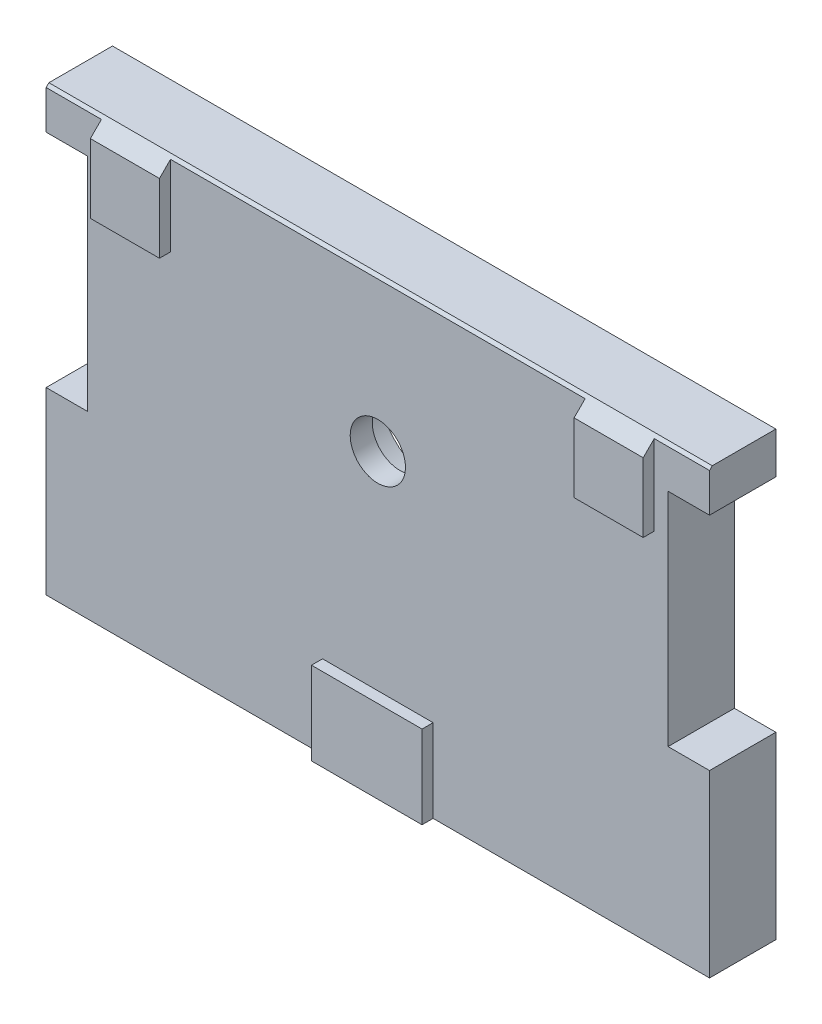
ISO-10303-21;
HEADER;
FILE_DESCRIPTION(('STEP AP214'),'2;1');
FILE_NAME('part.step','',(''),(''),'','','');
FILE_SCHEMA(('AUTOMOTIVE_DESIGN { 1 0 10303 214 1 1 1 1 }'));
ENDSEC;
DATA;
#1=APPLICATION_CONTEXT('core data for automotive mechanical design processes');
#2=APPLICATION_PROTOCOL_DEFINITION('international standard','automotive_design',2000,#1);
#3=PRODUCT_CONTEXT('',#1,'mechanical');
#4=PRODUCT('Part','Part','',(#3));
#5=PRODUCT_RELATED_PRODUCT_CATEGORY('part','',(#4));
#6=PRODUCT_DEFINITION_FORMATION('','',#4);
#7=PRODUCT_DEFINITION_CONTEXT('part definition',#1,'design');
#8=PRODUCT_DEFINITION('design','',#6,#7);
#9=PRODUCT_DEFINITION_SHAPE('','',#8);
#10=(LENGTH_UNIT() NAMED_UNIT(*) SI_UNIT(.MILLI.,.METRE.));
#11=(NAMED_UNIT(*) PLANE_ANGLE_UNIT() SI_UNIT($,.RADIAN.));
#12=(NAMED_UNIT(*) SI_UNIT($,.STERADIAN.) SOLID_ANGLE_UNIT());
#13=UNCERTAINTY_MEASURE_WITH_UNIT(LENGTH_MEASURE(1.E-05),#10,'distance_accuracy_value','');
#14=(GEOMETRIC_REPRESENTATION_CONTEXT(3) GLOBAL_UNCERTAINTY_ASSIGNED_CONTEXT((#13)) GLOBAL_UNIT_ASSIGNED_CONTEXT((#10,
#11,#12)) REPRESENTATION_CONTEXT('',''));
#15=CARTESIAN_POINT('',(0.,0.,0.));
#16=DIRECTION('',(0.,0.,1.));
#17=DIRECTION('',(1.,0.,0.));
#18=AXIS2_PLACEMENT_3D('',#15,#16,#17);
#19=CARTESIAN_POINT('',(-10.1117315438873,0.,2.4));
#20=DIRECTION('',(-1.,0.,0.));
#21=DIRECTION('',(0.,0.,1.));
#22=AXIS2_PLACEMENT_3D('',#19,#20,#21);
#23=PLANE('',#22);
#24=DIRECTION('',(0.,1.,0.));
#25=VECTOR('',#24,1.);
#26=CARTESIAN_POINT('',(-10.1117315438873,8.,2.4));
#27=LINE('',#26,#25);
#28=CARTESIAN_POINT('',(-10.1117315438873,0.,2.4));
#29=VERTEX_POINT('',#28);
#30=CARTESIAN_POINT('',(-10.1117315438873,3.,2.4));
#31=VERTEX_POINT('',#30);
#32=EDGE_CURVE('E303',#29,#31,#27,.T.);
#33=ORIENTED_EDGE('',*,*,#32,.F.);
#34=DIRECTION('',(0.,0.,1.));
#35=VECTOR('',#34,1.);
#36=CARTESIAN_POINT('',(-10.1117315438873,0.,2.4));
#37=LINE('',#36,#35);
#38=CARTESIAN_POINT('',(-10.1117315438873,0.,2.8));
#39=VERTEX_POINT('',#38);
#40=EDGE_CURVE('E230',#29,#39,#37,.T.);
#41=ORIENTED_EDGE('',*,*,#40,.T.);
#42=DIRECTION('',(0.,-1.,0.));
#43=VECTOR('',#42,1.);
#44=CARTESIAN_POINT('',(-10.1117315438873,1.5,2.8));
#45=LINE('',#44,#43);
#46=CARTESIAN_POINT('',(-10.1117315438873,3.,2.8));
#47=VERTEX_POINT('',#46);
#48=EDGE_CURVE('E317',#47,#39,#45,.T.);
#49=ORIENTED_EDGE('',*,*,#48,.F.);
#50=DIRECTION('',(0.,0.,1.));
#51=VECTOR('',#50,1.);
#52=CARTESIAN_POINT('',(-10.1117315438873,3.,2.4));
#53=LINE('',#52,#51);
#54=EDGE_CURVE('E228',#31,#47,#53,.T.);
#55=ORIENTED_EDGE('',*,*,#54,.F.);
#56=EDGE_LOOP('',(#33,#41,#49,#55));
#57=FACE_BOUND('',#56,.T.);
#58=ADVANCED_FACE('F16',(#57),#23,.T.);
#59=CARTESIAN_POINT('',(-10.1117315438873,3.,2.4));
#60=DIRECTION('',(0.,1.,0.));
#61=DIRECTION('',(0.,0.,1.));
#62=AXIS2_PLACEMENT_3D('',#59,#60,#61);
#63=PLANE('',#62);
#64=DIRECTION('',(1.,0.,0.));
#65=VECTOR('',#64,1.);
#66=CARTESIAN_POINT('',(-8.11173154388726,3.,2.4));
#67=LINE('',#66,#65);
#68=CARTESIAN_POINT('',(-6.11173154388727,3.,2.4));
#69=VERTEX_POINT('',#68);
#70=EDGE_CURVE('E301',#31,#69,#67,.T.);
#71=ORIENTED_EDGE('',*,*,#70,.F.);
#72=ORIENTED_EDGE('',*,*,#54,.T.);
#73=DIRECTION('',(1.,0.,0.));
#74=VECTOR('',#73,1.);
#75=CARTESIAN_POINT('',(-8.11173154388727,3.,2.8));
#76=LINE('',#75,#74);
#77=CARTESIAN_POINT('',(-6.11173154388727,3.,2.8));
#78=VERTEX_POINT('',#77);
#79=EDGE_CURVE('E311',#78,#47,#76,.F.);
#80=ORIENTED_EDGE('',*,*,#79,.F.);
#81=DIRECTION('',(0.,0.,-1.));
#82=VECTOR('',#81,1.);
#83=CARTESIAN_POINT('',(-6.11173154388727,3.,2.4));
#84=LINE('',#83,#82);
#85=EDGE_CURVE('E224',#69,#78,#84,.F.);
#86=ORIENTED_EDGE('',*,*,#85,.F.);
#87=EDGE_LOOP('',(#71,#72,#80,#86));
#88=FACE_BOUND('',#87,.T.);
#89=ADVANCED_FACE('F649',(#88),#63,.T.);
#90=CARTESIAN_POINT('',(-6.11173154388727,3.,2.4));
#91=DIRECTION('',(1.,0.,0.));
#92=DIRECTION('',(0.,0.,-1.));
#93=AXIS2_PLACEMENT_3D('',#90,#91,#92);
#94=PLANE('',#93);
#95=DIRECTION('',(0.,1.,0.));
#96=VECTOR('',#95,1.);
#97=CARTESIAN_POINT('',(-6.11173154388727,8.,2.4));
#98=LINE('',#97,#96);
#99=CARTESIAN_POINT('',(-6.11173154388727,0.,2.4));
#100=VERTEX_POINT('',#99);
#101=EDGE_CURVE('E298',#69,#100,#98,.F.);
#102=ORIENTED_EDGE('',*,*,#101,.F.);
#103=ORIENTED_EDGE('',*,*,#85,.T.);
#104=DIRECTION('',(0.,-1.,0.));
#105=VECTOR('',#104,1.);
#106=CARTESIAN_POINT('',(-6.11173154388726,1.5,2.8));
#107=LINE('',#106,#105);
#108=CARTESIAN_POINT('',(-6.11173154388726,0.,2.8));
#109=VERTEX_POINT('',#108);
#110=EDGE_CURVE('E314',#109,#78,#107,.F.);
#111=ORIENTED_EDGE('',*,*,#110,.F.);
#112=DIRECTION('',(0.,0.,-1.));
#113=VECTOR('',#112,1.);
#114=CARTESIAN_POINT('',(-6.11173154388727,0.,2.4));
#115=LINE('',#114,#113);
#116=EDGE_CURVE('E226',#109,#100,#115,.T.);
#117=ORIENTED_EDGE('',*,*,#116,.T.);
#118=EDGE_LOOP('',(#102,#103,#111,#117));
#119=FACE_BOUND('',#118,.T.);
#120=ADVANCED_FACE('F642',(#119),#94,.T.);
#121=CARTESIAN_POINT('',(1.88826845611274,16.,2.4));
#122=DIRECTION('',(1.,0.,0.));
#123=DIRECTION('',(0.,1.,0.));
#124=AXIS2_PLACEMENT_3D('',#121,#122,#123);
#125=PLANE('',#124);
#126=DIRECTION('',(0.,0.,1.));
#127=VECTOR('',#126,1.);
#128=CARTESIAN_POINT('',(1.88826845611273,13.,2.4));
#129=LINE('',#128,#127);
#130=CARTESIAN_POINT('',(1.88826845611273,13.,2.4));
#131=VERTEX_POINT('',#130);
#132=CARTESIAN_POINT('',(1.88826845611273,13.,2.8));
#133=VERTEX_POINT('',#132);
#134=EDGE_CURVE('E220',#131,#133,#129,.T.);
#135=ORIENTED_EDGE('',*,*,#134,.F.);
#136=DIRECTION('',(0.,1.,0.));
#137=VECTOR('',#136,1.);
#138=CARTESIAN_POINT('',(1.88826845611274,8.,2.4));
#139=LINE('',#138,#137);
#140=CARTESIAN_POINT('',(1.88826845611274,15.9,2.4));
#141=VERTEX_POINT('',#140);
#142=EDGE_CURVE('E294',#141,#131,#139,.F.);
#143=ORIENTED_EDGE('',*,*,#142,.F.);
#144=DIRECTION('',(0.,-0.707106781186549,0.707106781186546));
#145=VECTOR('',#144,1.);
#146=CARTESIAN_POINT('',(1.88826845611274,15.9,2.4));
#147=LINE('',#146,#145);
#148=CARTESIAN_POINT('',(1.88826845611274,15.5,2.8));
#149=VERTEX_POINT('',#148);
#150=EDGE_CURVE('E222',#141,#149,#147,.T.);
#151=ORIENTED_EDGE('',*,*,#150,.T.);
#152=DIRECTION('',(0.,-1.,0.));
#153=VECTOR('',#152,1.);
#154=CARTESIAN_POINT('',(1.88826845611273,14.5,2.8));
#155=LINE('',#154,#153);
#156=EDGE_CURVE('E324',#133,#149,#155,.F.);
#157=ORIENTED_EDGE('',*,*,#156,.F.);
#158=EDGE_LOOP('',(#135,#143,#151,#157));
#159=FACE_BOUND('',#158,.T.);
#160=ADVANCED_FACE('F345',(#159),#125,.T.);
#161=CARTESIAN_POINT('',(1.88826845611273,13.,2.4));
#162=DIRECTION('',(0.,-1.,0.));
#163=DIRECTION('',(1.,0.,0.));
#164=AXIS2_PLACEMENT_3D('',#161,#162,#163);
#165=PLANE('',#164);
#166=DIRECTION('',(1.,0.,0.));
#167=VECTOR('',#166,1.);
#168=CARTESIAN_POINT('',(-8.11173154388726,13.,2.4));
#169=LINE('',#168,#167);
#170=CARTESIAN_POINT('',(-0.611731543887264,13.,2.4));
#171=VERTEX_POINT('',#170);
#172=EDGE_CURVE('E292',#131,#171,#169,.F.);
#173=ORIENTED_EDGE('',*,*,#172,.F.);
#174=ORIENTED_EDGE('',*,*,#134,.T.);
#175=DIRECTION('',(1.,0.,0.));
#176=VECTOR('',#175,1.);
#177=CARTESIAN_POINT('',(0.638268456112734,13.,2.8));
#178=LINE('',#177,#176);
#179=CARTESIAN_POINT('',(-0.611731543887265,13.,2.8));
#180=VERTEX_POINT('',#179);
#181=EDGE_CURVE('E327',#180,#133,#178,.T.);
#182=ORIENTED_EDGE('',*,*,#181,.F.);
#183=DIRECTION('',(0.,0.,1.));
#184=VECTOR('',#183,1.);
#185=CARTESIAN_POINT('',(-0.611731543887265,13.,2.4));
#186=LINE('',#185,#184);
#187=EDGE_CURVE('E216',#171,#180,#186,.T.);
#188=ORIENTED_EDGE('',*,*,#187,.F.);
#189=EDGE_LOOP('',(#173,#174,#182,#188));
#190=FACE_BOUND('',#189,.T.);
#191=ADVANCED_FACE('F340',(#190),#165,.T.);
#192=CARTESIAN_POINT('',(-0.611731543887265,13.,2.4));
#193=DIRECTION('',(-1.,0.,0.));
#194=DIRECTION('',(0.,-1.,0.));
#195=AXIS2_PLACEMENT_3D('',#192,#193,#194);
#196=PLANE('',#195);
#197=ORIENTED_EDGE('',*,*,#187,.T.);
#198=DIRECTION('',(0.,-1.,0.));
#199=VECTOR('',#198,1.);
#200=CARTESIAN_POINT('',(-0.611731543887268,14.5,2.8));
#201=LINE('',#200,#199);
#202=CARTESIAN_POINT('',(-0.611731543887268,15.5,2.8));
#203=VERTEX_POINT('',#202);
#204=EDGE_CURVE('E208',#203,#180,#201,.T.);
#205=ORIENTED_EDGE('',*,*,#204,.F.);
#206=DIRECTION('',(0.,0.707106781186549,-0.707106781186546));
#207=VECTOR('',#206,1.);
#208=CARTESIAN_POINT('',(-0.611731543887268,15.5,2.8));
#209=LINE('',#208,#207);
#210=CARTESIAN_POINT('',(-0.611731543887267,15.9,2.4));
#211=VERTEX_POINT('',#210);
#212=EDGE_CURVE('E218',#203,#211,#209,.T.);
#213=ORIENTED_EDGE('',*,*,#212,.T.);
#214=DIRECTION('',(0.,1.,0.));
#215=VECTOR('',#214,1.);
#216=CARTESIAN_POINT('',(-0.611731543887264,8.,2.4));
#217=LINE('',#216,#215);
#218=EDGE_CURVE('E289',#171,#211,#217,.T.);
#219=ORIENTED_EDGE('',*,*,#218,.F.);
#220=EDGE_LOOP('',(#197,#205,#213,#219));
#221=FACE_BOUND('',#220,.T.);
#222=ADVANCED_FACE('F350',(#221),#196,.T.);
#223=CARTESIAN_POINT('',(-15.6117315438873,16.,2.4));
#224=DIRECTION('',(1.,0.,0.));
#225=DIRECTION('',(0.,0.,-1.));
#226=AXIS2_PLACEMENT_3D('',#223,#224,#225);
#227=PLANE('',#226);
#228=DIRECTION('',(0.,0.,-1.));
#229=VECTOR('',#228,1.);
#230=CARTESIAN_POINT('',(-15.6117315438873,13.,2.4));
#231=LINE('',#230,#229);
#232=CARTESIAN_POINT('',(-15.6117315438873,13.,2.4));
#233=VERTEX_POINT('',#232);
#234=CARTESIAN_POINT('',(-15.6117315438873,13.,2.8));
#235=VERTEX_POINT('',#234);
#236=EDGE_CURVE('E181',#233,#235,#231,.F.);
#237=ORIENTED_EDGE('',*,*,#236,.F.);
#238=DIRECTION('',(0.,1.,0.));
#239=VECTOR('',#238,1.);
#240=CARTESIAN_POINT('',(-15.6117315438873,8.,2.4));
#241=LINE('',#240,#239);
#242=CARTESIAN_POINT('',(-15.6117315438873,15.9,2.4));
#243=VERTEX_POINT('',#242);
#244=EDGE_CURVE('E287',#243,#233,#241,.F.);
#245=ORIENTED_EDGE('',*,*,#244,.F.);
#246=DIRECTION('',(0.,-0.707106781186549,0.707106781186546));
#247=VECTOR('',#246,1.);
#248=CARTESIAN_POINT('',(-15.6117315438873,15.9,2.4));
#249=LINE('',#248,#247);
#250=CARTESIAN_POINT('',(-15.6117315438873,15.5,2.8));
#251=VERTEX_POINT('',#250);
#252=EDGE_CURVE('E214',#243,#251,#249,.T.);
#253=ORIENTED_EDGE('',*,*,#252,.T.);
#254=DIRECTION('',(0.,-1.,0.));
#255=VECTOR('',#254,1.);
#256=CARTESIAN_POINT('',(-15.6117315438873,14.5,2.8));
#257=LINE('',#256,#255);
#258=EDGE_CURVE('E206',#235,#251,#257,.F.);
#259=ORIENTED_EDGE('',*,*,#258,.F.);
#260=EDGE_LOOP('',(#237,#245,#253,#259));
#261=FACE_BOUND('',#260,.T.);
#262=ADVANCED_FACE('F616',(#261),#227,.T.);
#263=CARTESIAN_POINT('',(-15.6117315438873,13.,2.4));
#264=DIRECTION('',(0.,-1.,0.));
#265=DIRECTION('',(0.,0.,-1.));
#266=AXIS2_PLACEMENT_3D('',#263,#264,#265);
#267=PLANE('',#266);
#268=DIRECTION('',(1.,0.,0.));
#269=VECTOR('',#268,1.);
#270=CARTESIAN_POINT('',(-8.11173154388726,13.,2.4));
#271=LINE('',#270,#269);
#272=CARTESIAN_POINT('',(-18.1117315438873,13.,2.4));
#273=VERTEX_POINT('',#272);
#274=EDGE_CURVE('E285',#233,#273,#271,.F.);
#275=ORIENTED_EDGE('',*,*,#274,.F.);
#276=ORIENTED_EDGE('',*,*,#236,.T.);
#277=DIRECTION('',(1.,0.,0.));
#278=VECTOR('',#277,1.);
#279=CARTESIAN_POINT('',(-16.8617315438873,13.,2.8));
#280=LINE('',#279,#278);
#281=CARTESIAN_POINT('',(-18.1117315438873,13.,2.8));
#282=VERTEX_POINT('',#281);
#283=EDGE_CURVE('E200',#282,#235,#280,.T.);
#284=ORIENTED_EDGE('',*,*,#283,.F.);
#285=DIRECTION('',(0.,0.,1.));
#286=VECTOR('',#285,1.);
#287=CARTESIAN_POINT('',(-18.1117315438873,13.,2.4));
#288=LINE('',#287,#286);
#289=EDGE_CURVE('E188',#273,#282,#288,.T.);
#290=ORIENTED_EDGE('',*,*,#289,.F.);
#291=EDGE_LOOP('',(#275,#276,#284,#290));
#292=FACE_BOUND('',#291,.T.);
#293=ADVANCED_FACE('F205',(#292),#267,.T.);
#294=CARTESIAN_POINT('',(-18.1117315438873,13.,2.4));
#295=DIRECTION('',(-1.,0.,0.));
#296=DIRECTION('',(0.,-1.,0.));
#297=AXIS2_PLACEMENT_3D('',#294,#295,#296);
#298=PLANE('',#297);
#299=ORIENTED_EDGE('',*,*,#289,.T.);
#300=DIRECTION('',(0.,-1.,0.));
#301=VECTOR('',#300,1.);
#302=CARTESIAN_POINT('',(-18.1117315438873,14.5,2.8));
#303=LINE('',#302,#301);
#304=CARTESIAN_POINT('',(-18.1117315438873,15.5,2.8));
#305=VERTEX_POINT('',#304);
#306=EDGE_CURVE('E191',#305,#282,#303,.T.);
#307=ORIENTED_EDGE('',*,*,#306,.F.);
#308=DIRECTION('',(0.,0.707106781186546,-0.707106781186549));
#309=VECTOR('',#308,1.);
#310=CARTESIAN_POINT('',(-18.1117315438873,15.5,2.8));
#311=LINE('',#310,#309);
#312=CARTESIAN_POINT('',(-18.1117315438873,15.9,2.4));
#313=VERTEX_POINT('',#312);
#314=EDGE_CURVE('E195',#305,#313,#311,.T.);
#315=ORIENTED_EDGE('',*,*,#314,.T.);
#316=DIRECTION('',(0.,1.,0.));
#317=VECTOR('',#316,1.);
#318=CARTESIAN_POINT('',(-18.1117315438873,8.,2.4));
#319=LINE('',#318,#317);
#320=EDGE_CURVE('E194',#273,#313,#319,.T.);
#321=ORIENTED_EDGE('',*,*,#320,.F.);
#322=EDGE_LOOP('',(#299,#307,#315,#321));
#323=FACE_BOUND('',#322,.T.);
#324=ADVANCED_FACE('F190',(#323),#298,.T.);
#325=CARTESIAN_POINT('',(-16.8617315438873,14.5,2.8));
#326=DIRECTION('',(0.,0.,1.));
#327=DIRECTION('',(0.,-1.,0.));
#328=AXIS2_PLACEMENT_3D('',#325,#326,#327);
#329=PLANE('',#328);
#330=ORIENTED_EDGE('',*,*,#283,.T.);
#331=ORIENTED_EDGE('',*,*,#258,.T.);
#332=DIRECTION('',(1.,0.,0.));
#333=VECTOR('',#332,1.);
#334=CARTESIAN_POINT('',(-18.4867315438873,15.5,2.8));
#335=LINE('',#334,#333);
#336=EDGE_CURVE('E203',#305,#251,#335,.T.);
#337=ORIENTED_EDGE('',*,*,#336,.F.);
#338=ORIENTED_EDGE('',*,*,#306,.T.);
#339=EDGE_LOOP('',(#330,#331,#337,#338));
#340=FACE_BOUND('',#339,.T.);
#341=ADVANCED_FACE('F198',(#340),#329,.T.);
#342=CARTESIAN_POINT('',(0.638268456112734,14.5,2.8));
#343=DIRECTION('',(0.,0.,1.));
#344=DIRECTION('',(0.,-1.,0.));
#345=AXIS2_PLACEMENT_3D('',#342,#343,#344);
#346=PLANE('',#345);
#347=ORIENTED_EDGE('',*,*,#181,.T.);
#348=ORIENTED_EDGE('',*,*,#156,.T.);
#349=DIRECTION('',(1.,0.,0.));
#350=VECTOR('',#349,1.);
#351=CARTESIAN_POINT('',(-18.4867315438873,15.5,2.8));
#352=LINE('',#351,#350);
#353=EDGE_CURVE('E269',#203,#149,#352,.T.);
#354=ORIENTED_EDGE('',*,*,#353,.F.);
#355=ORIENTED_EDGE('',*,*,#204,.T.);
#356=EDGE_LOOP('',(#347,#348,#354,#355));
#357=FACE_BOUND('',#356,.T.);
#358=ADVANCED_FACE('F334',(#357),#346,.T.);
#359=CARTESIAN_POINT('',(-8.11173154388726,10.5,28.9440840242009));
#360=DIRECTION('',(0.,0.,-1.));
#361=DIRECTION('',(-1.,0.,0.));
#362=AXIS2_PLACEMENT_3D('',#359,#360,#361);
#363=CYLINDRICAL_SURFACE('',#362,1.);
#364=CARTESIAN_POINT('',(-8.11173154388726,10.5,2.4));
#365=DIRECTION('',(0.,0.,-1.));
#366=DIRECTION('',(-1.,0.,0.));
#367=AXIS2_PLACEMENT_3D('',#364,#365,#366);
#368=CIRCLE('',#367,1.);
#369=CARTESIAN_POINT('',(-9.11173154388726,10.5,2.4));
#370=VERTEX_POINT('',#369);
#371=EDGE_CURVE('E19',#370,#370,#368,.T.);
#372=ORIENTED_EDGE('',*,*,#371,.F.);
#373=EDGE_LOOP('',(#372));
#374=FACE_BOUND('',#373,.T.);
#375=CARTESIAN_POINT('',(-8.11173154388726,10.5,1.6));
#376=DIRECTION('',(0.,0.,-1.));
#377=DIRECTION('',(-1.,0.,0.));
#378=AXIS2_PLACEMENT_3D('',#375,#376,#377);
#379=CIRCLE('',#378,1.);
#380=CARTESIAN_POINT('',(-9.11173154388726,10.5,1.6));
#381=VERTEX_POINT('',#380);
#382=EDGE_CURVE('E236',#381,#381,#379,.T.);
#383=ORIENTED_EDGE('',*,*,#382,.T.);
#384=EDGE_LOOP('',(#383));
#385=FACE_BOUND('',#384,.T.);
#386=ADVANCED_FACE('F471',(#374,#385),#363,.F.);
#387=CARTESIAN_POINT('',(-18.6117315438873,14.5,2.4));
#388=DIRECTION('',(0.,1.,0.));
#389=DIRECTION('',(0.,0.,1.));
#390=AXIS2_PLACEMENT_3D('',#387,#388,#389);
#391=PLANE('',#390);
#392=DIRECTION('',(0.,0.,-1.));
#393=VECTOR('',#392,1.);
#394=CARTESIAN_POINT('',(-18.6117315438873,14.5,2.4));
#395=LINE('',#394,#393);
#396=CARTESIAN_POINT('',(-18.6117315438873,14.5,0.));
#397=VERTEX_POINT('',#396);
#398=CARTESIAN_POINT('',(-18.6117315438873,14.5,2.4));
#399=VERTEX_POINT('',#398);
#400=EDGE_CURVE('E238',#397,#399,#395,.F.);
#401=ORIENTED_EDGE('',*,*,#400,.T.);
#402=DIRECTION('',(1.,0.,0.));
#403=VECTOR('',#402,1.);
#404=CARTESIAN_POINT('',(-8.11173154388726,14.5,2.4));
#405=LINE('',#404,#403);
#406=CARTESIAN_POINT('',(-20.1117315438873,14.5,2.4));
#407=VERTEX_POINT('',#406);
#408=EDGE_CURVE('E307',#407,#399,#405,.T.);
#409=ORIENTED_EDGE('',*,*,#408,.F.);
#410=DIRECTION('',(0.,0.,1.));
#411=VECTOR('',#410,1.);
#412=CARTESIAN_POINT('',(-20.1117315438873,14.5,0.));
#413=LINE('',#412,#411);
#414=CARTESIAN_POINT('',(-20.1117315438873,14.5,0.));
#415=VERTEX_POINT('',#414);
#416=EDGE_CURVE('E246',#415,#407,#413,.T.);
#417=ORIENTED_EDGE('',*,*,#416,.F.);
#418=DIRECTION('',(1.,0.,0.));
#419=VECTOR('',#418,1.);
#420=CARTESIAN_POINT('',(-18.6117315438873,14.5,0.));
#421=LINE('',#420,#419);
#422=EDGE_CURVE('E322',#397,#415,#421,.F.);
#423=ORIENTED_EDGE('',*,*,#422,.F.);
#424=EDGE_LOOP('',(#401,#409,#417,#423));
#425=FACE_BOUND('',#424,.T.);
#426=ADVANCED_FACE('F416',(#425),#391,.F.);
#427=CARTESIAN_POINT('',(-20.1117315438873,6.5,2.4));
#428=DIRECTION('',(0.,-1.,0.));
#429=DIRECTION('',(1.,0.,0.));
#430=AXIS2_PLACEMENT_3D('',#427,#428,#429);
#431=PLANE('',#430);
#432=DIRECTION('',(0.,0.,1.));
#433=VECTOR('',#432,1.);
#434=CARTESIAN_POINT('',(-20.1117315438873,6.5,0.));
#435=LINE('',#434,#433);
#436=CARTESIAN_POINT('',(-20.1117315438873,6.5,2.4));
#437=VERTEX_POINT('',#436);
#438=CARTESIAN_POINT('',(-20.1117315438873,6.5,0.));
#439=VERTEX_POINT('',#438);
#440=EDGE_CURVE('E400',#437,#439,#435,.F.);
#441=ORIENTED_EDGE('',*,*,#440,.F.);
#442=DIRECTION('',(1.,0.,0.));
#443=VECTOR('',#442,1.);
#444=CARTESIAN_POINT('',(-8.11173154388726,6.5,2.4));
#445=LINE('',#444,#443);
#446=CARTESIAN_POINT('',(-18.6117315438873,6.5,2.4));
#447=VERTEX_POINT('',#446);
#448=EDGE_CURVE('E305',#447,#437,#445,.F.);
#449=ORIENTED_EDGE('',*,*,#448,.F.);
#450=DIRECTION('',(0.,0.,-1.));
#451=VECTOR('',#450,1.);
#452=CARTESIAN_POINT('',(-18.6117315438873,6.5,2.4));
#453=LINE('',#452,#451);
#454=CARTESIAN_POINT('',(-18.6117315438873,6.5,0.));
#455=VERTEX_POINT('',#454);
#456=EDGE_CURVE('E403',#447,#455,#453,.T.);
#457=ORIENTED_EDGE('',*,*,#456,.T.);
#458=DIRECTION('',(1.,0.,0.));
#459=VECTOR('',#458,1.);
#460=CARTESIAN_POINT('',(-20.1117315438873,6.5,0.));
#461=LINE('',#460,#459);
#462=EDGE_CURVE('E320',#439,#455,#461,.T.);
#463=ORIENTED_EDGE('',*,*,#462,.F.);
#464=EDGE_LOOP('',(#441,#449,#457,#463));
#465=FACE_BOUND('',#464,.T.);
#466=ADVANCED_FACE('F460',(#465),#431,.F.);
#467=CARTESIAN_POINT('',(-8.11173154388727,1.5,2.8));
#468=DIRECTION('',(0.,0.,1.));
#469=DIRECTION('',(0.,-1.,0.));
#470=AXIS2_PLACEMENT_3D('',#467,#468,#469);
#471=PLANE('',#470);
#472=ORIENTED_EDGE('',*,*,#110,.T.);
#473=ORIENTED_EDGE('',*,*,#79,.T.);
#474=ORIENTED_EDGE('',*,*,#48,.T.);
#475=DIRECTION('',(1.,0.,0.));
#476=VECTOR('',#475,1.);
#477=CARTESIAN_POINT('',(3.88826845611274,0.,2.8));
#478=LINE('',#477,#476);
#479=EDGE_CURVE('E391',#109,#39,#478,.F.);
#480=ORIENTED_EDGE('',*,*,#479,.F.);
#481=EDGE_LOOP('',(#472,#473,#474,#480));
#482=FACE_BOUND('',#481,.T.);
#483=ADVANCED_FACE('F462',(#482),#471,.T.);
#484=CARTESIAN_POINT('',(2.38826845611274,6.5,2.4));
#485=DIRECTION('',(0.,-1.,0.));
#486=DIRECTION('',(0.,0.,-1.));
#487=AXIS2_PLACEMENT_3D('',#484,#485,#486);
#488=PLANE('',#487);
#489=DIRECTION('',(0.,0.,1.));
#490=VECTOR('',#489,1.);
#491=CARTESIAN_POINT('',(2.38826845611274,6.5,2.4));
#492=LINE('',#491,#490);
#493=CARTESIAN_POINT('',(2.38826845611274,6.5,0.));
#494=VERTEX_POINT('',#493);
#495=CARTESIAN_POINT('',(2.38826845611274,6.5,2.4));
#496=VERTEX_POINT('',#495);
#497=EDGE_CURVE('E378',#494,#496,#492,.T.);
#498=ORIENTED_EDGE('',*,*,#497,.T.);
#499=DIRECTION('',(1.,0.,0.));
#500=VECTOR('',#499,1.);
#501=CARTESIAN_POINT('',(-8.11173154388726,6.5,2.4));
#502=LINE('',#501,#500);
#503=CARTESIAN_POINT('',(3.88826845611274,6.5,2.4));
#504=VERTEX_POINT('',#503);
#505=EDGE_CURVE('E296',#504,#496,#502,.F.);
#506=ORIENTED_EDGE('',*,*,#505,.F.);
#507=DIRECTION('',(0.,0.,-1.));
#508=VECTOR('',#507,1.);
#509=CARTESIAN_POINT('',(3.88826845611274,6.5,0.));
#510=LINE('',#509,#508);
#511=CARTESIAN_POINT('',(3.88826845611274,6.5,0.));
#512=VERTEX_POINT('',#511);
#513=EDGE_CURVE('E385',#512,#504,#510,.F.);
#514=ORIENTED_EDGE('',*,*,#513,.F.);
#515=DIRECTION('',(1.,0.,0.));
#516=VECTOR('',#515,1.);
#517=CARTESIAN_POINT('',(2.38826845611274,6.5,0.));
#518=LINE('',#517,#516);
#519=EDGE_CURVE('E309',#494,#512,#518,.T.);
#520=ORIENTED_EDGE('',*,*,#519,.F.);
#521=EDGE_LOOP('',(#498,#506,#514,#520));
#522=FACE_BOUND('',#521,.T.);
#523=ADVANCED_FACE('F445',(#522),#488,.F.);
#524=CARTESIAN_POINT('',(-8.11173154388726,8.,2.4));
#525=DIRECTION('',(0.,0.,1.));
#526=DIRECTION('',(1.,0.,0.));
#527=AXIS2_PLACEMENT_3D('',#524,#525,#526);
#528=PLANE('',#527);
#529=ORIENTED_EDGE('',*,*,#274,.T.);
#530=ORIENTED_EDGE('',*,*,#320,.T.);
#531=DIRECTION('',(1.,0.,0.));
#532=VECTOR('',#531,1.);
#533=CARTESIAN_POINT('',(-18.4867315438873,15.9,2.4));
#534=LINE('',#533,#532);
#535=CARTESIAN_POINT('',(-20.1117315438873,15.9,2.4));
#536=VERTEX_POINT('',#535);
#537=EDGE_CURVE('E276',#536,#313,#534,.T.);
#538=ORIENTED_EDGE('',*,*,#537,.F.);
#539=DIRECTION('',(0.,1.,0.));
#540=VECTOR('',#539,1.);
#541=CARTESIAN_POINT('',(-20.1117315438873,0.,2.4));
#542=LINE('',#541,#540);
#543=EDGE_CURVE('E239',#407,#536,#542,.T.);
#544=ORIENTED_EDGE('',*,*,#543,.F.);
#545=ORIENTED_EDGE('',*,*,#408,.T.);
#546=DIRECTION('',(0.,1.,0.));
#547=VECTOR('',#546,1.);
#548=CARTESIAN_POINT('',(-18.6117315438873,6.5,2.4));
#549=LINE('',#548,#547);
#550=EDGE_CURVE('E243',#399,#447,#549,.F.);
#551=ORIENTED_EDGE('',*,*,#550,.T.);
#552=ORIENTED_EDGE('',*,*,#448,.T.);
#553=DIRECTION('',(0.,1.,0.));
#554=VECTOR('',#553,1.);
#555=CARTESIAN_POINT('',(-20.1117315438873,0.,2.4));
#556=LINE('',#555,#554);
#557=CARTESIAN_POINT('',(-20.1117315438873,0.,2.4));
#558=VERTEX_POINT('',#557);
#559=EDGE_CURVE('E397',#558,#437,#556,.T.);
#560=ORIENTED_EDGE('',*,*,#559,.F.);
#561=DIRECTION('',(1.,0.,0.));
#562=VECTOR('',#561,1.);
#563=CARTESIAN_POINT('',(3.88826845611274,0.,2.4));
#564=LINE('',#563,#562);
#565=EDGE_CURVE('E389',#29,#558,#564,.F.);
#566=ORIENTED_EDGE('',*,*,#565,.F.);
#567=ORIENTED_EDGE('',*,*,#32,.T.);
#568=ORIENTED_EDGE('',*,*,#70,.T.);
#569=ORIENTED_EDGE('',*,*,#101,.T.);
#570=DIRECTION('',(1.,0.,0.));
#571=VECTOR('',#570,1.);
#572=CARTESIAN_POINT('',(3.88826845611274,0.,2.4));
#573=LINE('',#572,#571);
#574=CARTESIAN_POINT('',(3.88826845611274,0.,2.4));
#575=VERTEX_POINT('',#574);
#576=EDGE_CURVE('E394',#575,#100,#573,.F.);
#577=ORIENTED_EDGE('',*,*,#576,.F.);
#578=DIRECTION('',(0.,1.,0.));
#579=VECTOR('',#578,1.);
#580=CARTESIAN_POINT('',(3.88826845611274,16.,2.4));
#581=LINE('',#580,#579);
#582=EDGE_CURVE('E383',#504,#575,#581,.F.);
#583=ORIENTED_EDGE('',*,*,#582,.F.);
#584=ORIENTED_EDGE('',*,*,#505,.T.);
#585=DIRECTION('',(0.,-1.,0.));
#586=VECTOR('',#585,1.);
#587=CARTESIAN_POINT('',(2.38826845611273,14.5,2.4));
#588=LINE('',#587,#586);
#589=CARTESIAN_POINT('',(2.38826845611273,14.5,2.4));
#590=VERTEX_POINT('',#589);
#591=EDGE_CURVE('E375',#496,#590,#588,.F.);
#592=ORIENTED_EDGE('',*,*,#591,.T.);
#593=DIRECTION('',(1.,0.,0.));
#594=VECTOR('',#593,1.);
#595=CARTESIAN_POINT('',(3.88826845611274,14.5,2.4));
#596=LINE('',#595,#594);
#597=CARTESIAN_POINT('',(3.88826845611274,14.5,2.4));
#598=VERTEX_POINT('',#597);
#599=EDGE_CURVE('E281',#590,#598,#596,.T.);
#600=ORIENTED_EDGE('',*,*,#599,.T.);
#601=DIRECTION('',(0.,1.,0.));
#602=VECTOR('',#601,1.);
#603=CARTESIAN_POINT('',(3.88826845611274,16.,2.4));
#604=LINE('',#603,#602);
#605=CARTESIAN_POINT('',(3.88826845611274,15.9,2.4));
#606=VERTEX_POINT('',#605);
#607=EDGE_CURVE('E262',#606,#598,#604,.F.);
#608=ORIENTED_EDGE('',*,*,#607,.F.);
#609=DIRECTION('',(1.,0.,0.));
#610=VECTOR('',#609,1.);
#611=CARTESIAN_POINT('',(-18.4867315438873,15.9,2.4));
#612=LINE('',#611,#610);
#613=EDGE_CURVE('E267',#141,#606,#612,.T.);
#614=ORIENTED_EDGE('',*,*,#613,.F.);
#615=ORIENTED_EDGE('',*,*,#142,.T.);
#616=ORIENTED_EDGE('',*,*,#172,.T.);
#617=ORIENTED_EDGE('',*,*,#218,.T.);
#618=DIRECTION('',(1.,0.,0.));
#619=VECTOR('',#618,1.);
#620=CARTESIAN_POINT('',(-18.4867315438873,15.9,2.4));
#621=LINE('',#620,#619);
#622=EDGE_CURVE('E272',#243,#211,#621,.T.);
#623=ORIENTED_EDGE('',*,*,#622,.F.);
#624=ORIENTED_EDGE('',*,*,#244,.T.);
#625=EDGE_LOOP('',(#529,#530,#538,#544,#545,#551,#552,#560,#566,#567,#568,#569,#577,#583,#584,
#592,#600,#608,#614,#615,#616,#617,#623,#624));
#626=FACE_BOUND('',#625,.T.);
#627=ORIENTED_EDGE('',*,*,#371,.T.);
#628=EDGE_LOOP('',(#627));
#629=FACE_BOUND('',#628,.T.);
#630=ADVANCED_FACE('F352',(#626,#629),#528,.T.);
#631=CARTESIAN_POINT('',(3.88826845611274,14.5,2.4));
#632=DIRECTION('',(0.,1.,0.));
#633=DIRECTION('',(0.,0.,1.));
#634=AXIS2_PLACEMENT_3D('',#631,#632,#633);
#635=PLANE('',#634);
#636=DIRECTION('',(0.,0.,-1.));
#637=VECTOR('',#636,1.);
#638=CARTESIAN_POINT('',(3.88826845611274,14.5,0.));
#639=LINE('',#638,#637);
#640=CARTESIAN_POINT('',(3.88826845611274,14.5,0.));
#641=VERTEX_POINT('',#640);
#642=EDGE_CURVE('E259',#598,#641,#639,.T.);
#643=ORIENTED_EDGE('',*,*,#642,.F.);
#644=ORIENTED_EDGE('',*,*,#599,.F.);
#645=DIRECTION('',(0.,0.,1.));
#646=VECTOR('',#645,1.);
#647=CARTESIAN_POINT('',(2.38826845611273,14.5,2.4));
#648=LINE('',#647,#646);
#649=CARTESIAN_POINT('',(2.38826845611273,14.5,0.));
#650=VERTEX_POINT('',#649);
#651=EDGE_CURVE('E369',#590,#650,#648,.F.);
#652=ORIENTED_EDGE('',*,*,#651,.T.);
#653=DIRECTION('',(1.,0.,0.));
#654=VECTOR('',#653,1.);
#655=CARTESIAN_POINT('',(3.88826845611274,14.5,0.));
#656=LINE('',#655,#654);
#657=EDGE_CURVE('E279',#641,#650,#656,.F.);
#658=ORIENTED_EDGE('',*,*,#657,.F.);
#659=EDGE_LOOP('',(#643,#644,#652,#658));
#660=FACE_BOUND('',#659,.T.);
#661=ADVANCED_FACE('F438',(#660),#635,.F.);
#662=CARTESIAN_POINT('',(-18.4867315438873,15.75,2.55));
#663=DIRECTION('',(0.,0.707106781186546,0.707106781186549));
#664=DIRECTION('',(0.,-0.707106781186549,0.707106781186546));
#665=AXIS2_PLACEMENT_3D('',#662,#663,#664);
#666=PLANE('',#665);
#667=ORIENTED_EDGE('',*,*,#150,.F.);
#668=ORIENTED_EDGE('',*,*,#613,.T.);
#669=DIRECTION('',(0.,-0.707106781186548,0.707106781186548));
#670=VECTOR('',#669,1.);
#671=CARTESIAN_POINT('',(3.88826845611274,16.,2.3));
#672=LINE('',#671,#670);
#673=CARTESIAN_POINT('',(3.88826845611274,16.,2.3));
#674=VERTEX_POINT('',#673);
#675=EDGE_CURVE('E264',#674,#606,#672,.T.);
#676=ORIENTED_EDGE('',*,*,#675,.F.);
#677=DIRECTION('',(1.,0.,0.));
#678=VECTOR('',#677,1.);
#679=CARTESIAN_POINT('',(-20.1117315438873,16.,2.3));
#680=LINE('',#679,#678);
#681=CARTESIAN_POINT('',(-20.1117315438873,16.,2.3));
#682=VERTEX_POINT('',#681);
#683=EDGE_CURVE('E365',#682,#674,#680,.T.);
#684=ORIENTED_EDGE('',*,*,#683,.F.);
#685=DIRECTION('',(0.,0.707106781186548,-0.707106781186548));
#686=VECTOR('',#685,1.);
#687=CARTESIAN_POINT('',(-20.1117315438873,15.9,2.4));
#688=LINE('',#687,#686);
#689=EDGE_CURVE('E255',#536,#682,#688,.T.);
#690=ORIENTED_EDGE('',*,*,#689,.F.);
#691=ORIENTED_EDGE('',*,*,#537,.T.);
#692=ORIENTED_EDGE('',*,*,#314,.F.);
#693=ORIENTED_EDGE('',*,*,#336,.T.);
#694=ORIENTED_EDGE('',*,*,#252,.F.);
#695=ORIENTED_EDGE('',*,*,#622,.T.);
#696=ORIENTED_EDGE('',*,*,#212,.F.);
#697=ORIENTED_EDGE('',*,*,#353,.T.);
#698=EDGE_LOOP('',(#667,#668,#676,#684,#690,#691,#692,#693,#694,#695,#696,#697));
#699=FACE_BOUND('',#698,.T.);
#700=ADVANCED_FACE('F348',(#699),#666,.T.);
#701=CARTESIAN_POINT('',(3.88826845611274,16.,0.));
#702=DIRECTION('',(1.,0.,0.));
#703=DIRECTION('',(0.,0.,-1.));
#704=AXIS2_PLACEMENT_3D('',#701,#702,#703);
#705=PLANE('',#704);
#706=DIRECTION('',(0.,1.,0.));
#707=VECTOR('',#706,1.);
#708=CARTESIAN_POINT('',(3.88826845611274,16.,0.));
#709=LINE('',#708,#707);
#710=CARTESIAN_POINT('',(3.88826845611274,16.,0.));
#711=VERTEX_POINT('',#710);
#712=EDGE_CURVE('E257',#641,#711,#709,.T.);
#713=ORIENTED_EDGE('',*,*,#712,.T.);
#714=DIRECTION('',(0.,0.,1.));
#715=VECTOR('',#714,1.);
#716=CARTESIAN_POINT('',(3.88826845611274,16.,0.));
#717=LINE('',#716,#715);
#718=EDGE_CURVE('E361',#674,#711,#717,.F.);
#719=ORIENTED_EDGE('',*,*,#718,.F.);
#720=ORIENTED_EDGE('',*,*,#675,.T.);
#721=ORIENTED_EDGE('',*,*,#607,.T.);
#722=ORIENTED_EDGE('',*,*,#642,.T.);
#723=EDGE_LOOP('',(#713,#719,#720,#721,#722));
#724=FACE_BOUND('',#723,.T.);
#725=ADVANCED_FACE('F359',(#724),#705,.T.);
#726=CARTESIAN_POINT('',(-20.1117315438873,0.,0.));
#727=DIRECTION('',(-1.,0.,0.));
#728=DIRECTION('',(0.,0.,1.));
#729=AXIS2_PLACEMENT_3D('',#726,#727,#728);
#730=PLANE('',#729);
#731=ORIENTED_EDGE('',*,*,#416,.T.);
#732=ORIENTED_EDGE('',*,*,#543,.T.);
#733=ORIENTED_EDGE('',*,*,#689,.T.);
#734=DIRECTION('',(0.,0.,1.));
#735=VECTOR('',#734,1.);
#736=CARTESIAN_POINT('',(-20.1117315438873,16.,0.));
#737=LINE('',#736,#735);
#738=CARTESIAN_POINT('',(-20.1117315438873,16.,0.));
#739=VERTEX_POINT('',#738);
#740=EDGE_CURVE('E235',#739,#682,#737,.T.);
#741=ORIENTED_EDGE('',*,*,#740,.F.);
#742=DIRECTION('',(0.,1.,0.));
#743=VECTOR('',#742,1.);
#744=CARTESIAN_POINT('',(-20.1117315438873,0.,0.));
#745=LINE('',#744,#743);
#746=EDGE_CURVE('E34',#739,#415,#745,.F.);
#747=ORIENTED_EDGE('',*,*,#746,.T.);
#748=EDGE_LOOP('',(#731,#732,#733,#741,#747));
#749=FACE_BOUND('',#748,.T.);
#750=ADVANCED_FACE('F500',(#749),#730,.T.);
#751=CARTESIAN_POINT('',(-8.11173154388726,10.5,1.6));
#752=DIRECTION('',(0.,0.,1.));
#753=DIRECTION('',(1.,0.,0.));
#754=AXIS2_PLACEMENT_3D('',#751,#752,#753);
#755=PLANE('',#754);
#756=ORIENTED_EDGE('',*,*,#382,.F.);
#757=EDGE_LOOP('',(#756));
#758=FACE_BOUND('',#757,.T.);
#759=CARTESIAN_POINT('',(-8.11173154388726,10.5,1.6));
#760=DIRECTION('',(0.,0.,-1.));
#761=DIRECTION('',(-1.,0.,0.));
#762=AXIS2_PLACEMENT_3D('',#759,#760,#761);
#763=CIRCLE('',#762,2.5);
#764=CARTESIAN_POINT('',(-10.6117315438873,10.5,1.6));
#765=VERTEX_POINT('',#764);
#766=EDGE_CURVE('E232',#765,#765,#763,.T.);
#767=ORIENTED_EDGE('',*,*,#766,.T.);
#768=EDGE_LOOP('',(#767));
#769=FACE_BOUND('',#768,.T.);
#770=ADVANCED_FACE('F497',(#758,#769),#755,.F.);
#771=CARTESIAN_POINT('',(-18.6117315438873,6.5,2.4));
#772=DIRECTION('',(1.,0.,0.));
#773=DIRECTION('',(0.,0.,-1.));
#774=AXIS2_PLACEMENT_3D('',#771,#772,#773);
#775=PLANE('',#774);
#776=ORIENTED_EDGE('',*,*,#456,.F.);
#777=ORIENTED_EDGE('',*,*,#550,.F.);
#778=ORIENTED_EDGE('',*,*,#400,.F.);
#779=DIRECTION('',(0.,1.,0.));
#780=VECTOR('',#779,1.);
#781=CARTESIAN_POINT('',(-18.6117315438873,8.,0.));
#782=LINE('',#781,#780);
#783=EDGE_CURVE('E234',#397,#455,#782,.F.);
#784=ORIENTED_EDGE('',*,*,#783,.T.);
#785=EDGE_LOOP('',(#776,#777,#778,#784));
#786=FACE_BOUND('',#785,.T.);
#787=ADVANCED_FACE('F412',(#786),#775,.F.);
#788=CARTESIAN_POINT('',(-20.1117315438873,0.,0.));
#789=DIRECTION('',(-1.,0.,0.));
#790=DIRECTION('',(0.,0.,1.));
#791=AXIS2_PLACEMENT_3D('',#788,#789,#790);
#792=PLANE('',#791);
#793=DIRECTION('',(0.,0.,1.));
#794=VECTOR('',#793,1.);
#795=CARTESIAN_POINT('',(-20.1117315438873,0.,0.));
#796=LINE('',#795,#794);
#797=CARTESIAN_POINT('',(-20.1117315438873,0.,0.));
#798=VERTEX_POINT('',#797);
#799=EDGE_CURVE('E387',#558,#798,#796,.F.);
#800=ORIENTED_EDGE('',*,*,#799,.F.);
#801=ORIENTED_EDGE('',*,*,#559,.T.);
#802=ORIENTED_EDGE('',*,*,#440,.T.);
#803=DIRECTION('',(0.,1.,0.));
#804=VECTOR('',#803,1.);
#805=CARTESIAN_POINT('',(-20.1117315438873,8.,0.));
#806=LINE('',#805,#804);
#807=EDGE_CURVE('E420',#439,#798,#806,.F.);
#808=ORIENTED_EDGE('',*,*,#807,.T.);
#809=EDGE_LOOP('',(#800,#801,#802,#808));
#810=FACE_BOUND('',#809,.T.);
#811=ADVANCED_FACE('F457',(#810),#792,.T.);
#812=CARTESIAN_POINT('',(3.88826845611274,0.,0.));
#813=DIRECTION('',(0.,-1.,0.));
#814=DIRECTION('',(1.,0.,0.));
#815=AXIS2_PLACEMENT_3D('',#812,#813,#814);
#816=PLANE('',#815);
#817=DIRECTION('',(1.,0.,0.));
#818=VECTOR('',#817,1.);
#819=CARTESIAN_POINT('',(-8.11173154388726,0.,0.));
#820=LINE('',#819,#818);
#821=CARTESIAN_POINT('',(3.88826845611274,0.,0.));
#822=VERTEX_POINT('',#821);
#823=EDGE_CURVE('E422',#798,#822,#820,.T.);
#824=ORIENTED_EDGE('',*,*,#823,.T.);
#825=DIRECTION('',(0.,0.,-1.));
#826=VECTOR('',#825,1.);
#827=CARTESIAN_POINT('',(3.88826845611274,0.,0.));
#828=LINE('',#827,#826);
#829=EDGE_CURVE('E381',#575,#822,#828,.T.);
#830=ORIENTED_EDGE('',*,*,#829,.F.);
#831=ORIENTED_EDGE('',*,*,#576,.T.);
#832=ORIENTED_EDGE('',*,*,#116,.F.);
#833=ORIENTED_EDGE('',*,*,#479,.T.);
#834=ORIENTED_EDGE('',*,*,#40,.F.);
#835=ORIENTED_EDGE('',*,*,#565,.T.);
#836=ORIENTED_EDGE('',*,*,#799,.T.);
#837=EDGE_LOOP('',(#824,#830,#831,#832,#833,#834,#835,#836));
#838=FACE_BOUND('',#837,.T.);
#839=ADVANCED_FACE('F453',(#838),#816,.T.);
#840=CARTESIAN_POINT('',(3.88826845611274,16.,0.));
#841=DIRECTION('',(1.,0.,0.));
#842=DIRECTION('',(0.,0.,-1.));
#843=AXIS2_PLACEMENT_3D('',#840,#841,#842);
#844=PLANE('',#843);
#845=ORIENTED_EDGE('',*,*,#829,.T.);
#846=DIRECTION('',(0.,1.,0.));
#847=VECTOR('',#846,1.);
#848=CARTESIAN_POINT('',(3.88826845611274,8.,0.));
#849=LINE('',#848,#847);
#850=EDGE_CURVE('E427',#822,#512,#849,.T.);
#851=ORIENTED_EDGE('',*,*,#850,.T.);
#852=ORIENTED_EDGE('',*,*,#513,.T.);
#853=ORIENTED_EDGE('',*,*,#582,.T.);
#854=EDGE_LOOP('',(#845,#851,#852,#853));
#855=FACE_BOUND('',#854,.T.);
#856=ADVANCED_FACE('F488',(#855),#844,.T.);
#857=CARTESIAN_POINT('',(2.38826845611273,14.5,2.4));
#858=DIRECTION('',(-1.,0.,0.));
#859=DIRECTION('',(0.,-1.,0.));
#860=AXIS2_PLACEMENT_3D('',#857,#858,#859);
#861=PLANE('',#860);
#862=ORIENTED_EDGE('',*,*,#651,.F.);
#863=ORIENTED_EDGE('',*,*,#591,.F.);
#864=ORIENTED_EDGE('',*,*,#497,.F.);
#865=DIRECTION('',(0.,1.,0.));
#866=VECTOR('',#865,1.);
#867=CARTESIAN_POINT('',(2.38826845611274,8.,0.));
#868=LINE('',#867,#866);
#869=EDGE_CURVE('E430',#494,#650,#868,.T.);
#870=ORIENTED_EDGE('',*,*,#869,.T.);
#871=EDGE_LOOP('',(#862,#863,#864,#870));
#872=FACE_BOUND('',#871,.T.);
#873=ADVANCED_FACE('F442',(#872),#861,.F.);
#874=CARTESIAN_POINT('',(-20.1117315438873,16.,0.));
#875=DIRECTION('',(0.,1.,0.));
#876=DIRECTION('',(0.,0.,1.));
#877=AXIS2_PLACEMENT_3D('',#874,#875,#876);
#878=PLANE('',#877);
#879=DIRECTION('',(1.,0.,0.));
#880=VECTOR('',#879,1.);
#881=CARTESIAN_POINT('',(-8.11173154388726,16.,0.));
#882=LINE('',#881,#880);
#883=EDGE_CURVE('E25',#711,#739,#882,.F.);
#884=ORIENTED_EDGE('',*,*,#883,.T.);
#885=ORIENTED_EDGE('',*,*,#740,.T.);
#886=ORIENTED_EDGE('',*,*,#683,.T.);
#887=ORIENTED_EDGE('',*,*,#718,.T.);
#888=EDGE_LOOP('',(#884,#885,#886,#887));
#889=FACE_BOUND('',#888,.T.);
#890=ADVANCED_FACE('F433',(#889),#878,.T.);
#891=CARTESIAN_POINT('',(-8.11173154388726,10.5,0.8));
#892=DIRECTION('',(0.,0.,-1.));
#893=DIRECTION('',(-1.,0.,0.));
#894=AXIS2_PLACEMENT_3D('',#891,#892,#893);
#895=CYLINDRICAL_SURFACE('',#894,2.5);
#896=ORIENTED_EDGE('',*,*,#766,.F.);
#897=EDGE_LOOP('',(#896));
#898=FACE_BOUND('',#897,.T.);
#899=CARTESIAN_POINT('',(-8.11173154388726,10.5,0.));
#900=DIRECTION('',(0.,0.,-1.));
#901=DIRECTION('',(-1.,0.,0.));
#902=AXIS2_PLACEMENT_3D('',#899,#900,#901);
#903=CIRCLE('',#902,2.5);
#904=CARTESIAN_POINT('',(-10.6117315438873,10.5,0.));
#905=VERTEX_POINT('',#904);
#906=EDGE_CURVE('E10',#905,#905,#903,.T.);
#907=ORIENTED_EDGE('',*,*,#906,.T.);
#908=EDGE_LOOP('',(#907));
#909=FACE_BOUND('',#908,.T.);
#910=ADVANCED_FACE('F474',(#898,#909),#895,.F.);
#911=CARTESIAN_POINT('',(-8.11173154388726,8.,0.));
#912=DIRECTION('',(0.,0.,1.));
#913=DIRECTION('',(1.,0.,0.));
#914=AXIS2_PLACEMENT_3D('',#911,#912,#913);
#915=PLANE('',#914);
#916=ORIENTED_EDGE('',*,*,#906,.F.);
#917=EDGE_LOOP('',(#916));
#918=FACE_BOUND('',#917,.T.);
#919=ORIENTED_EDGE('',*,*,#746,.F.);
#920=ORIENTED_EDGE('',*,*,#883,.F.);
#921=ORIENTED_EDGE('',*,*,#712,.F.);
#922=ORIENTED_EDGE('',*,*,#657,.T.);
#923=ORIENTED_EDGE('',*,*,#869,.F.);
#924=ORIENTED_EDGE('',*,*,#519,.T.);
#925=ORIENTED_EDGE('',*,*,#850,.F.);
#926=ORIENTED_EDGE('',*,*,#823,.F.);
#927=ORIENTED_EDGE('',*,*,#807,.F.);
#928=ORIENTED_EDGE('',*,*,#462,.T.);
#929=ORIENTED_EDGE('',*,*,#783,.F.);
#930=ORIENTED_EDGE('',*,*,#422,.T.);
#931=EDGE_LOOP('',(#919,#920,#921,#922,#923,#924,#925,#926,#927,#928,#929,#930));
#932=FACE_BOUND('',#931,.T.);
#933=ADVANCED_FACE('F418',(#918,#932),#915,.F.);
#934=CLOSED_SHELL('',(#58,#89,#120,#160,#191,#222,#262,#293,#324,#341,#358,#386,#426,#466,#483,
#523,#630,#661,#700,#725,#750,#770,#787,#811,#839,#856,#873,#890,#910,#933));
#935=MANIFOLD_SOLID_BREP('B1',#934);
#936=ADVANCED_BREP_SHAPE_REPRESENTATION('',(#18,#935),#14);
#937=SHAPE_DEFINITION_REPRESENTATION(#9,#936);
ENDSEC;
END-ISO-10303-21;
